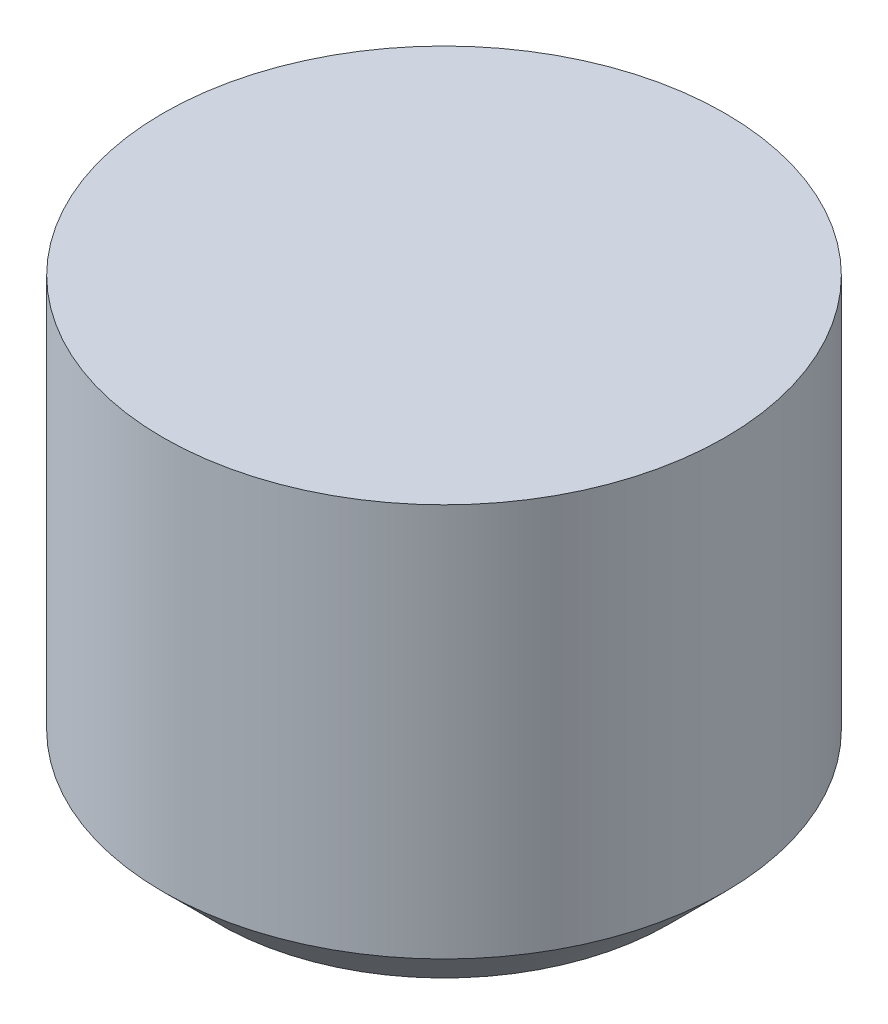
ISO-10303-21;
HEADER;
FILE_DESCRIPTION(('STEP AP214'),'2;1');
FILE_NAME('part.step','',(''),(''),'','','');
FILE_SCHEMA(('AUTOMOTIVE_DESIGN { 1 0 10303 214 1 1 1 1 }'));
ENDSEC;
DATA;
#1=APPLICATION_CONTEXT('core data for automotive mechanical design processes');
#2=APPLICATION_PROTOCOL_DEFINITION('international standard','automotive_design',2000,#1);
#3=PRODUCT_CONTEXT('',#1,'mechanical');
#4=PRODUCT('Part','Part','',(#3));
#5=PRODUCT_RELATED_PRODUCT_CATEGORY('part','',(#4));
#6=PRODUCT_DEFINITION_FORMATION('','',#4);
#7=PRODUCT_DEFINITION_CONTEXT('part definition',#1,'design');
#8=PRODUCT_DEFINITION('design','',#6,#7);
#9=PRODUCT_DEFINITION_SHAPE('','',#8);
#10=(LENGTH_UNIT() NAMED_UNIT(*) SI_UNIT(.MILLI.,.METRE.));
#11=(NAMED_UNIT(*) PLANE_ANGLE_UNIT() SI_UNIT($,.RADIAN.));
#12=(NAMED_UNIT(*) SI_UNIT($,.STERADIAN.) SOLID_ANGLE_UNIT());
#13=UNCERTAINTY_MEASURE_WITH_UNIT(LENGTH_MEASURE(1.E-05),#10,'distance_accuracy_value','');
#14=(GEOMETRIC_REPRESENTATION_CONTEXT(3) GLOBAL_UNCERTAINTY_ASSIGNED_CONTEXT((#13)) GLOBAL_UNIT_ASSIGNED_CONTEXT((#10,
#11,#12)) REPRESENTATION_CONTEXT('',''));
#15=CARTESIAN_POINT('',(0.,0.,0.));
#16=DIRECTION('',(0.,0.,1.));
#17=DIRECTION('',(1.,0.,0.));
#18=AXIS2_PLACEMENT_3D('',#15,#16,#17);
#19=CARTESIAN_POINT('',(0.,-2.,0.));
#20=DIRECTION('',(0.,1.,0.));
#21=DIRECTION('',(0.,0.,1.));
#22=AXIS2_PLACEMENT_3D('',#19,#20,#21);
#23=PLANE('',#22);
#24=CARTESIAN_POINT('',(0.,-1.99999999995271,0.));
#25=DIRECTION('',(0.,1.,0.));
#26=DIRECTION('',(-1.,0.,0.));
#27=AXIS2_PLACEMENT_3D('',#24,#25,#26);
#28=CIRCLE('',#27,2.00000000000955);
#29=CARTESIAN_POINT('',(-2.00000000000955,-1.99999999995271,0.));
#30=VERTEX_POINT('',#29);
#31=EDGE_CURVE('E18',#30,#30,#28,.T.);
#32=ORIENTED_EDGE('',*,*,#31,.F.);
#33=EDGE_LOOP('',(#32));
#34=FACE_BOUND('',#33,.T.);
#35=ADVANCED_FACE('F15',(#34),#23,.F.);
#36=CARTESIAN_POINT('',(0.,-1.50000000002137,0.));
#37=DIRECTION('',(0.,1.,0.));
#38=DIRECTION('',(-1.,0.,0.));
#39=AXIS2_PLACEMENT_3D('',#36,#37,#38);
#40=CONICAL_SURFACE('',#39,2.49999999994088,0.785398163397448);
#41=ORIENTED_EDGE('',*,*,#31,.T.);
#42=EDGE_LOOP('',(#41));
#43=FACE_BOUND('',#42,.T.);
#44=CARTESIAN_POINT('',(0.,-1.5,0.));
#45=DIRECTION('',(0.,-1.,0.));
#46=DIRECTION('',(0.,0.,-1.));
#47=AXIS2_PLACEMENT_3D('',#44,#45,#46);
#48=CIRCLE('',#47,2.5);
#49=CARTESIAN_POINT('',(0.,-1.5,-2.5));
#50=VERTEX_POINT('',#49);
#51=EDGE_CURVE('E22',#50,#50,#48,.F.);
#52=ORIENTED_EDGE('',*,*,#51,.F.);
#53=EDGE_LOOP('',(#52));
#54=FACE_BOUND('',#53,.T.);
#55=ADVANCED_FACE('F32',(#43,#54),#40,.T.);
#56=CARTESIAN_POINT('',(0.,2.,0.));
#57=DIRECTION('',(0.,1.,0.));
#58=DIRECTION('',(0.,0.,1.));
#59=AXIS2_PLACEMENT_3D('',#56,#57,#58);
#60=PLANE('',#59);
#61=CARTESIAN_POINT('',(0.,2.,0.));
#62=DIRECTION('',(0.,-1.,0.));
#63=DIRECTION('',(0.,0.,-1.));
#64=AXIS2_PLACEMENT_3D('',#61,#62,#63);
#65=CIRCLE('',#64,2.5);
#66=CARTESIAN_POINT('',(0.,2.,-2.5));
#67=VERTEX_POINT('',#66);
#68=EDGE_CURVE('E10',#67,#67,#65,.T.);
#69=ORIENTED_EDGE('',*,*,#68,.F.);
#70=EDGE_LOOP('',(#69));
#71=FACE_BOUND('',#70,.T.);
#72=ADVANCED_FACE('F40',(#71),#60,.T.);
#73=CARTESIAN_POINT('',(0.,2.,0.));
#74=DIRECTION('',(0.,-1.,0.));
#75=DIRECTION('',(0.,0.,-1.));
#76=AXIS2_PLACEMENT_3D('',#73,#74,#75);
#77=CYLINDRICAL_SURFACE('',#76,2.5);
#78=ORIENTED_EDGE('',*,*,#68,.T.);
#79=EDGE_LOOP('',(#78));
#80=FACE_BOUND('',#79,.T.);
#81=ORIENTED_EDGE('',*,*,#51,.T.);
#82=EDGE_LOOP('',(#81));
#83=FACE_BOUND('',#82,.T.);
#84=ADVANCED_FACE('F41',(#80,#83),#77,.T.);
#85=CLOSED_SHELL('',(#35,#55,#72,#84));
#86=MANIFOLD_SOLID_BREP('B1',#85);
#87=ADVANCED_BREP_SHAPE_REPRESENTATION('',(#18,#86),#14);
#88=SHAPE_DEFINITION_REPRESENTATION(#9,#87);
ENDSEC;
END-ISO-10303-21;
